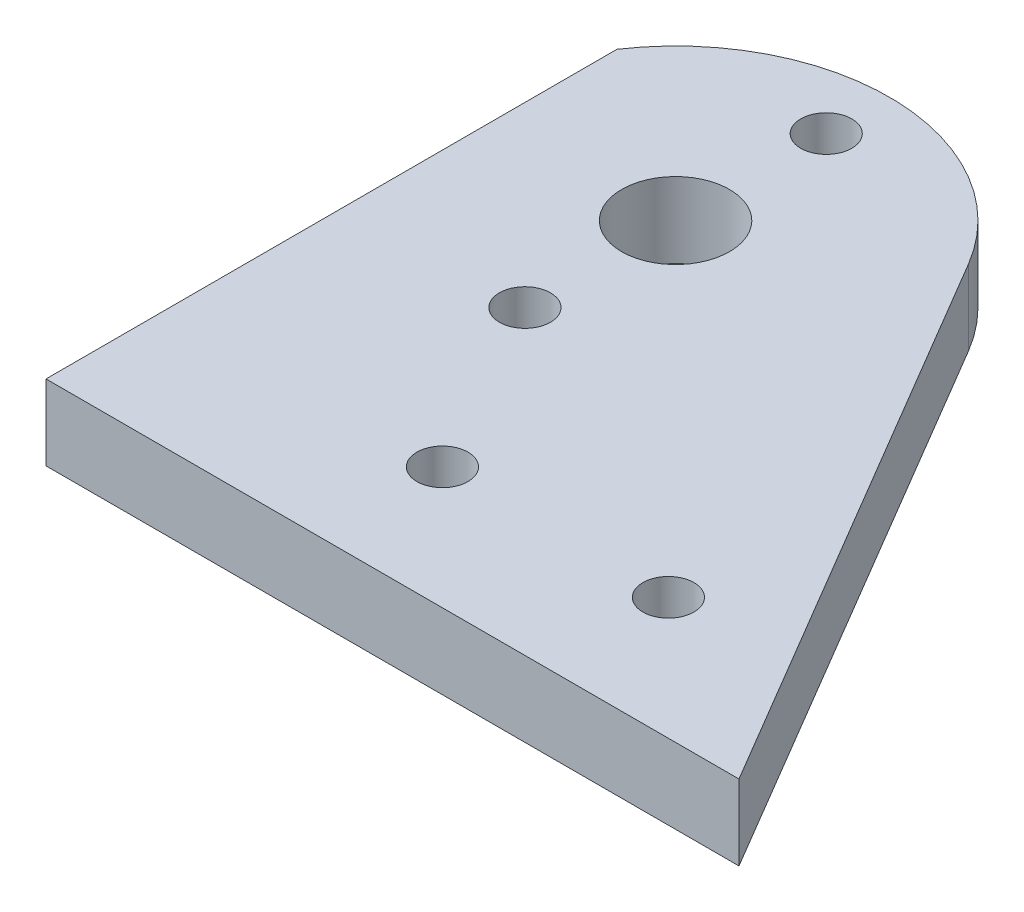
ISO-10303-21;
HEADER;
FILE_DESCRIPTION(('STEP AP214'),'2;1');
FILE_NAME('part.step','',(''),(''),'','','');
FILE_SCHEMA(('AUTOMOTIVE_DESIGN { 1 0 10303 214 1 1 1 1 }'));
ENDSEC;
DATA;
#1=APPLICATION_CONTEXT('core data for automotive mechanical design processes');
#2=APPLICATION_PROTOCOL_DEFINITION('international standard','automotive_design',2000,#1);
#3=PRODUCT_CONTEXT('',#1,'mechanical');
#4=PRODUCT('Part','Part','',(#3));
#5=PRODUCT_RELATED_PRODUCT_CATEGORY('part','',(#4));
#6=PRODUCT_DEFINITION_FORMATION('','',#4);
#7=PRODUCT_DEFINITION_CONTEXT('part definition',#1,'design');
#8=PRODUCT_DEFINITION('design','',#6,#7);
#9=PRODUCT_DEFINITION_SHAPE('','',#8);
#10=(LENGTH_UNIT() NAMED_UNIT(*) SI_UNIT(.MILLI.,.METRE.));
#11=(NAMED_UNIT(*) PLANE_ANGLE_UNIT() SI_UNIT($,.RADIAN.));
#12=(NAMED_UNIT(*) SI_UNIT($,.STERADIAN.) SOLID_ANGLE_UNIT());
#13=UNCERTAINTY_MEASURE_WITH_UNIT(LENGTH_MEASURE(1.E-05),#10,'distance_accuracy_value','');
#14=(GEOMETRIC_REPRESENTATION_CONTEXT(3) GLOBAL_UNCERTAINTY_ASSIGNED_CONTEXT((#13)) GLOBAL_UNIT_ASSIGNED_CONTEXT((#10,
#11,#12)) REPRESENTATION_CONTEXT('',''));
#15=CARTESIAN_POINT('',(0.,0.,0.));
#16=DIRECTION('',(0.,0.,1.));
#17=DIRECTION('',(1.,0.,0.));
#18=AXIS2_PLACEMENT_3D('',#15,#16,#17);
#19=CARTESIAN_POINT('',(84.0586669717715,206.6925,-49.6534159709337));
#20=DIRECTION('',(-0.861005539629258,0.,0.508595576787421));
#21=DIRECTION('',(0.508595576787421,0.,0.861005539629259));
#22=AXIS2_PLACEMENT_3D('',#19,#20,#21);
#23=PLANE('',#22);
#24=DIRECTION('',(-0.508595576787421,0.,-0.861005539629259));
#25=VECTOR('',#24,1.);
#26=CARTESIAN_POINT('',(84.0586669717715,200.3425,-49.6534159709337));
#27=LINE('',#26,#25);
#28=CARTESIAN_POINT('',(91.8210000000002,200.3425,-36.5125));
#29=VERTEX_POINT('',#28);
#30=CARTESIAN_POINT('',(63.8993515636374,200.3425,-83.7812830498717));
#31=VERTEX_POINT('',#30);
#32=EDGE_CURVE('E119',#29,#31,#27,.T.);
#33=ORIENTED_EDGE('',*,*,#32,.T.);
#34=DIRECTION('',(0.,-1.,0.));
#35=VECTOR('',#34,1.);
#36=CARTESIAN_POINT('',(63.8993515636374,206.6925,-83.7812830498717));
#37=LINE('',#36,#35);
#38=CARTESIAN_POINT('',(63.8993515636374,206.6925,-83.7812830498717));
#39=VERTEX_POINT('',#38);
#40=EDGE_CURVE('E11',#39,#31,#37,.T.);
#41=ORIENTED_EDGE('',*,*,#40,.F.);
#42=DIRECTION('',(-0.508595576787421,0.,-0.861005539629259));
#43=VECTOR('',#42,1.);
#44=CARTESIAN_POINT('',(84.0586669717715,206.6925,-49.6534159709337));
#45=LINE('',#44,#43);
#46=CARTESIAN_POINT('',(91.8210000000002,206.6925,-36.5125));
#47=VERTEX_POINT('',#46);
#48=EDGE_CURVE('E92',#47,#39,#45,.T.);
#49=ORIENTED_EDGE('',*,*,#48,.F.);
#50=DIRECTION('',(0.,-1.,0.));
#51=VECTOR('',#50,1.);
#52=CARTESIAN_POINT('',(91.8210000000002,206.6925,-36.5125));
#53=LINE('',#52,#51);
#54=EDGE_CURVE('E118',#47,#29,#53,.T.);
#55=ORIENTED_EDGE('',*,*,#54,.T.);
#56=EDGE_LOOP('',(#33,#41,#49,#55));
#57=FACE_BOUND('',#56,.T.);
#58=ADVANCED_FACE('F40',(#57),#23,.F.);
#59=CARTESIAN_POINT('',(48.37744504714,206.6925,-74.6125));
#60=DIRECTION('',(0.,-1.,0.));
#61=DIRECTION('',(0.,0.,-1.));
#62=AXIS2_PLACEMENT_3D('',#59,#60,#61);
#63=CYLINDRICAL_SURFACE('',#62,18.02765);
#64=CARTESIAN_POINT('',(48.37744504714,200.3425,-74.6125));
#65=DIRECTION('',(0.,1.,0.));
#66=DIRECTION('',(0.,0.,1.));
#67=AXIS2_PLACEMENT_3D('',#64,#65,#66);
#68=CIRCLE('',#67,18.02765);
#69=CARTESIAN_POINT('',(33.4010000000002,200.3425,-84.647551483301));
#70=VERTEX_POINT('',#69);
#71=EDGE_CURVE('E96',#31,#70,#68,.T.);
#72=ORIENTED_EDGE('',*,*,#71,.T.);
#73=DIRECTION('',(0.,-1.,0.));
#74=VECTOR('',#73,1.);
#75=CARTESIAN_POINT('',(33.4010000000002,206.6925,-84.647551483301));
#76=LINE('',#75,#74);
#77=CARTESIAN_POINT('',(33.4010000000002,206.6925,-84.647551483301));
#78=VERTEX_POINT('',#77);
#79=EDGE_CURVE('E48',#78,#70,#76,.T.);
#80=ORIENTED_EDGE('',*,*,#79,.F.);
#81=CARTESIAN_POINT('',(48.37744504714,206.6925,-74.6125));
#82=DIRECTION('',(0.,1.,0.));
#83=DIRECTION('',(0.,0.,1.));
#84=AXIS2_PLACEMENT_3D('',#81,#82,#83);
#85=CIRCLE('',#84,18.02765);
#86=EDGE_CURVE('E86',#39,#78,#85,.T.);
#87=ORIENTED_EDGE('',*,*,#86,.F.);
#88=ORIENTED_EDGE('',*,*,#40,.T.);
#89=EDGE_LOOP('',(#72,#80,#87,#88));
#90=FACE_BOUND('',#89,.T.);
#91=ADVANCED_FACE('F95',(#90),#63,.T.);
#92=CARTESIAN_POINT('',(33.4010000000001,206.6925,0.));
#93=DIRECTION('',(1.,0.,0.));
#94=DIRECTION('',(0.,0.,-1.));
#95=AXIS2_PLACEMENT_3D('',#92,#93,#94);
#96=PLANE('',#95);
#97=DIRECTION('',(0.,0.,1.));
#98=VECTOR('',#97,1.);
#99=CARTESIAN_POINT('',(33.4010000000001,200.3425,0.));
#100=LINE('',#99,#98);
#101=CARTESIAN_POINT('',(33.4010000000002,200.3425,-36.5125));
#102=VERTEX_POINT('',#101);
#103=EDGE_CURVE('E73',#70,#102,#100,.T.);
#104=ORIENTED_EDGE('',*,*,#103,.T.);
#105=DIRECTION('',(0.,-1.,0.));
#106=VECTOR('',#105,1.);
#107=CARTESIAN_POINT('',(33.4010000000002,206.6925,-36.5125));
#108=LINE('',#107,#106);
#109=CARTESIAN_POINT('',(33.4010000000002,206.6925,-36.5125));
#110=VERTEX_POINT('',#109);
#111=EDGE_CURVE('E97',#110,#102,#108,.T.);
#112=ORIENTED_EDGE('',*,*,#111,.F.);
#113=DIRECTION('',(0.,0.,1.));
#114=VECTOR('',#113,1.);
#115=CARTESIAN_POINT('',(33.4010000000001,206.6925,0.));
#116=LINE('',#115,#114);
#117=EDGE_CURVE('E90',#78,#110,#116,.T.);
#118=ORIENTED_EDGE('',*,*,#117,.F.);
#119=ORIENTED_EDGE('',*,*,#79,.T.);
#120=EDGE_LOOP('',(#104,#112,#118,#119));
#121=FACE_BOUND('',#120,.T.);
#122=ADVANCED_FACE('F98',(#121),#96,.F.);
#123=CARTESIAN_POINT('',(48.37744504714,206.6925,-87.3125));
#124=DIRECTION('',(0.,-1.,0.));
#125=DIRECTION('',(0.,0.,-1.));
#126=AXIS2_PLACEMENT_3D('',#123,#124,#125);
#127=CYLINDRICAL_SURFACE('',#126,2.15265);
#128=CARTESIAN_POINT('',(48.37744504714,206.6925,-87.3125));
#129=DIRECTION('',(0.,1.,0.));
#130=DIRECTION('',(0.,0.,1.));
#131=AXIS2_PLACEMENT_3D('',#128,#129,#130);
#132=CIRCLE('',#131,2.15265);
#133=CARTESIAN_POINT('',(48.37744504714,206.6925,-85.15985));
#134=VERTEX_POINT('',#133);
#135=EDGE_CURVE('E112',#134,#134,#132,.T.);
#136=ORIENTED_EDGE('',*,*,#135,.T.);
#137=EDGE_LOOP('',(#136));
#138=FACE_BOUND('',#137,.T.);
#139=CARTESIAN_POINT('',(48.37744504714,200.3425,-87.3125));
#140=DIRECTION('',(0.,1.,0.));
#141=DIRECTION('',(0.,0.,1.));
#142=AXIS2_PLACEMENT_3D('',#139,#140,#141);
#143=CIRCLE('',#142,2.15265);
#144=CARTESIAN_POINT('',(48.37744504714,200.3425,-85.15985));
#145=VERTEX_POINT('',#144);
#146=EDGE_CURVE('E134',#145,#145,#143,.T.);
#147=ORIENTED_EDGE('',*,*,#146,.F.);
#148=EDGE_LOOP('',(#147));
#149=FACE_BOUND('',#148,.T.);
#150=ADVANCED_FACE('F154',(#138,#149),#127,.F.);
#151=CARTESIAN_POINT('',(48.37744504714,206.6925,-74.6125));
#152=DIRECTION('',(0.,-1.,0.));
#153=DIRECTION('',(0.,0.,-1.));
#154=AXIS2_PLACEMENT_3D('',#151,#152,#153);
#155=CYLINDRICAL_SURFACE('',#154,4.5466);
#156=CARTESIAN_POINT('',(48.37744504714,206.6925,-74.6125));
#157=DIRECTION('',(0.,1.,0.));
#158=DIRECTION('',(0.,0.,1.));
#159=AXIS2_PLACEMENT_3D('',#156,#157,#158);
#160=CIRCLE('',#159,4.5466);
#161=CARTESIAN_POINT('',(48.37744504714,206.6925,-70.0659));
#162=VERTEX_POINT('',#161);
#163=EDGE_CURVE('E109',#162,#162,#160,.T.);
#164=ORIENTED_EDGE('',*,*,#163,.T.);
#165=EDGE_LOOP('',(#164));
#166=FACE_BOUND('',#165,.T.);
#167=CARTESIAN_POINT('',(48.37744504714,200.3425,-74.6125));
#168=DIRECTION('',(0.,1.,0.));
#169=DIRECTION('',(0.,0.,1.));
#170=AXIS2_PLACEMENT_3D('',#167,#168,#169);
#171=CIRCLE('',#170,4.5466);
#172=CARTESIAN_POINT('',(48.37744504714,200.3425,-70.0659));
#173=VERTEX_POINT('',#172);
#174=EDGE_CURVE('E131',#173,#173,#171,.T.);
#175=ORIENTED_EDGE('',*,*,#174,.F.);
#176=EDGE_LOOP('',(#175));
#177=FACE_BOUND('',#176,.T.);
#178=ADVANCED_FACE('F167',(#166,#177),#155,.F.);
#179=CARTESIAN_POINT('',(75.5816517718266,206.6925,-46.8042774764301));
#180=DIRECTION('',(0.,-1.,0.));
#181=DIRECTION('',(0.,0.,-1.));
#182=AXIS2_PLACEMENT_3D('',#179,#180,#181);
#183=CYLINDRICAL_SURFACE('',#182,2.15265000000001);
#184=CARTESIAN_POINT('',(75.5816517718266,206.6925,-46.8042774764301));
#185=DIRECTION('',(0.,1.,0.));
#186=DIRECTION('',(0.,0.,1.));
#187=AXIS2_PLACEMENT_3D('',#184,#185,#186);
#188=CIRCLE('',#187,2.15265000000001);
#189=CARTESIAN_POINT('',(75.5816517718266,206.6925,-44.6516274764301));
#190=VERTEX_POINT('',#189);
#191=EDGE_CURVE('E106',#190,#190,#188,.T.);
#192=ORIENTED_EDGE('',*,*,#191,.T.);
#193=EDGE_LOOP('',(#192));
#194=FACE_BOUND('',#193,.T.);
#195=CARTESIAN_POINT('',(75.5816517718266,200.3425,-46.8042774764301));
#196=DIRECTION('',(0.,1.,0.));
#197=DIRECTION('',(0.,0.,1.));
#198=AXIS2_PLACEMENT_3D('',#195,#196,#197);
#199=CIRCLE('',#198,2.15265000000001);
#200=CARTESIAN_POINT('',(75.5816517718266,200.3425,-44.6516274764301));
#201=VERTEX_POINT('',#200);
#202=EDGE_CURVE('E128',#201,#201,#199,.T.);
#203=ORIENTED_EDGE('',*,*,#202,.F.);
#204=EDGE_LOOP('',(#203));
#205=FACE_BOUND('',#204,.T.);
#206=ADVANCED_FACE('F163',(#194,#205),#183,.F.);
#207=CARTESIAN_POINT('',(56.5316517718266,206.6925,-46.8042774764301));
#208=DIRECTION('',(0.,-1.,0.));
#209=DIRECTION('',(0.,0.,-1.));
#210=AXIS2_PLACEMENT_3D('',#207,#208,#209);
#211=CYLINDRICAL_SURFACE('',#210,2.15265);
#212=CARTESIAN_POINT('',(56.5316517718266,206.6925,-46.8042774764301));
#213=DIRECTION('',(0.,1.,0.));
#214=DIRECTION('',(0.,0.,1.));
#215=AXIS2_PLACEMENT_3D('',#212,#213,#214);
#216=CIRCLE('',#215,2.15265);
#217=CARTESIAN_POINT('',(56.5316517718266,206.6925,-44.6516274764301));
#218=VERTEX_POINT('',#217);
#219=EDGE_CURVE('E100',#218,#218,#216,.T.);
#220=ORIENTED_EDGE('',*,*,#219,.T.);
#221=EDGE_LOOP('',(#220));
#222=FACE_BOUND('',#221,.T.);
#223=CARTESIAN_POINT('',(56.5316517718266,200.3425,-46.8042774764301));
#224=DIRECTION('',(0.,1.,0.));
#225=DIRECTION('',(0.,0.,1.));
#226=AXIS2_PLACEMENT_3D('',#223,#224,#225);
#227=CIRCLE('',#226,2.15265);
#228=CARTESIAN_POINT('',(56.5316517718266,200.3425,-44.6516274764301));
#229=VERTEX_POINT('',#228);
#230=EDGE_CURVE('E125',#229,#229,#227,.T.);
#231=ORIENTED_EDGE('',*,*,#230,.F.);
#232=EDGE_LOOP('',(#231));
#233=FACE_BOUND('',#232,.T.);
#234=ADVANCED_FACE('F160',(#222,#233),#211,.F.);
#235=CARTESIAN_POINT('',(0.,206.6925,-36.5125));
#236=DIRECTION('',(0.,0.,-1.));
#237=DIRECTION('',(-1.,0.,0.));
#238=AXIS2_PLACEMENT_3D('',#235,#236,#237);
#239=PLANE('',#238);
#240=DIRECTION('',(1.,0.,0.));
#241=VECTOR('',#240,1.);
#242=CARTESIAN_POINT('',(0.,200.3425,-36.5125));
#243=LINE('',#242,#241);
#244=EDGE_CURVE('E79',#102,#29,#243,.T.);
#245=ORIENTED_EDGE('',*,*,#244,.T.);
#246=ORIENTED_EDGE('',*,*,#54,.F.);
#247=DIRECTION('',(1.,0.,0.));
#248=VECTOR('',#247,1.);
#249=CARTESIAN_POINT('',(0.,206.6925,-36.5125));
#250=LINE('',#249,#248);
#251=EDGE_CURVE('E56',#110,#47,#250,.T.);
#252=ORIENTED_EDGE('',*,*,#251,.F.);
#253=ORIENTED_EDGE('',*,*,#111,.T.);
#254=EDGE_LOOP('',(#245,#246,#252,#253));
#255=FACE_BOUND('',#254,.T.);
#256=ADVANCED_FACE('F141',(#255),#239,.F.);
#257=CARTESIAN_POINT('',(48.37744504714,206.6925,-61.9125));
#258=DIRECTION('',(0.,-1.,0.));
#259=DIRECTION('',(0.,0.,-1.));
#260=AXIS2_PLACEMENT_3D('',#257,#258,#259);
#261=CYLINDRICAL_SURFACE('',#260,2.15265);
#262=CARTESIAN_POINT('',(48.37744504714,206.6925,-61.9125));
#263=DIRECTION('',(0.,1.,0.));
#264=DIRECTION('',(0.,0.,1.));
#265=AXIS2_PLACEMENT_3D('',#262,#263,#264);
#266=CIRCLE('',#265,2.15265);
#267=CARTESIAN_POINT('',(48.37744504714,206.6925,-59.75985));
#268=VERTEX_POINT('',#267);
#269=EDGE_CURVE('E115',#268,#268,#266,.F.);
#270=ORIENTED_EDGE('',*,*,#269,.F.);
#271=EDGE_LOOP('',(#270));
#272=FACE_BOUND('',#271,.T.);
#273=CARTESIAN_POINT('',(48.37744504714,200.3425,-61.9125));
#274=DIRECTION('',(0.,1.,0.));
#275=DIRECTION('',(0.,0.,1.));
#276=AXIS2_PLACEMENT_3D('',#273,#274,#275);
#277=CIRCLE('',#276,2.15265);
#278=CARTESIAN_POINT('',(48.37744504714,200.3425,-59.75985));
#279=VERTEX_POINT('',#278);
#280=EDGE_CURVE('E137',#279,#279,#277,.F.);
#281=ORIENTED_EDGE('',*,*,#280,.T.);
#282=EDGE_LOOP('',(#281));
#283=FACE_BOUND('',#282,.T.);
#284=ADVANCED_FACE('F159',(#272,#283),#261,.F.);
#285=CARTESIAN_POINT('',(0.,206.6925,0.));
#286=DIRECTION('',(0.,1.,0.));
#287=DIRECTION('',(0.,0.,1.));
#288=AXIS2_PLACEMENT_3D('',#285,#286,#287);
#289=PLANE('',#288);
#290=ORIENTED_EDGE('',*,*,#48,.T.);
#291=ORIENTED_EDGE('',*,*,#86,.T.);
#292=ORIENTED_EDGE('',*,*,#117,.T.);
#293=ORIENTED_EDGE('',*,*,#251,.T.);
#294=EDGE_LOOP('',(#290,#291,#292,#293));
#295=FACE_BOUND('',#294,.T.);
#296=ORIENTED_EDGE('',*,*,#219,.F.);
#297=EDGE_LOOP('',(#296));
#298=FACE_BOUND('',#297,.T.);
#299=ORIENTED_EDGE('',*,*,#191,.F.);
#300=EDGE_LOOP('',(#299));
#301=FACE_BOUND('',#300,.T.);
#302=ORIENTED_EDGE('',*,*,#163,.F.);
#303=EDGE_LOOP('',(#302));
#304=FACE_BOUND('',#303,.T.);
#305=ORIENTED_EDGE('',*,*,#135,.F.);
#306=EDGE_LOOP('',(#305));
#307=FACE_BOUND('',#306,.T.);
#308=ORIENTED_EDGE('',*,*,#269,.T.);
#309=EDGE_LOOP('',(#308));
#310=FACE_BOUND('',#309,.T.);
#311=ADVANCED_FACE('F87',(#295,#298,#301,#304,#307,#310),#289,.T.);
#312=CARTESIAN_POINT('',(0.,200.3425,0.));
#313=DIRECTION('',(0.,1.,0.));
#314=DIRECTION('',(0.,0.,1.));
#315=AXIS2_PLACEMENT_3D('',#312,#313,#314);
#316=PLANE('',#315);
#317=ORIENTED_EDGE('',*,*,#32,.F.);
#318=ORIENTED_EDGE('',*,*,#244,.F.);
#319=ORIENTED_EDGE('',*,*,#103,.F.);
#320=ORIENTED_EDGE('',*,*,#71,.F.);
#321=EDGE_LOOP('',(#317,#318,#319,#320));
#322=FACE_BOUND('',#321,.T.);
#323=ORIENTED_EDGE('',*,*,#230,.T.);
#324=EDGE_LOOP('',(#323));
#325=FACE_BOUND('',#324,.T.);
#326=ORIENTED_EDGE('',*,*,#202,.T.);
#327=EDGE_LOOP('',(#326));
#328=FACE_BOUND('',#327,.T.);
#329=ORIENTED_EDGE('',*,*,#174,.T.);
#330=EDGE_LOOP('',(#329));
#331=FACE_BOUND('',#330,.T.);
#332=ORIENTED_EDGE('',*,*,#146,.T.);
#333=EDGE_LOOP('',(#332));
#334=FACE_BOUND('',#333,.T.);
#335=ORIENTED_EDGE('',*,*,#280,.F.);
#336=EDGE_LOOP('',(#335));
#337=FACE_BOUND('',#336,.T.);
#338=ADVANCED_FACE('F144',(#322,#325,#328,#331,#334,#337),#316,.F.);
#339=CLOSED_SHELL('',(#58,#91,#122,#150,#178,#206,#234,#256,#284,#311,#338));
#340=MANIFOLD_SOLID_BREP('B2',#339);
#341=ADVANCED_BREP_SHAPE_REPRESENTATION('',(#18,#340),#14);
#342=SHAPE_DEFINITION_REPRESENTATION(#9,#341);
ENDSEC;
END-ISO-10303-21;
